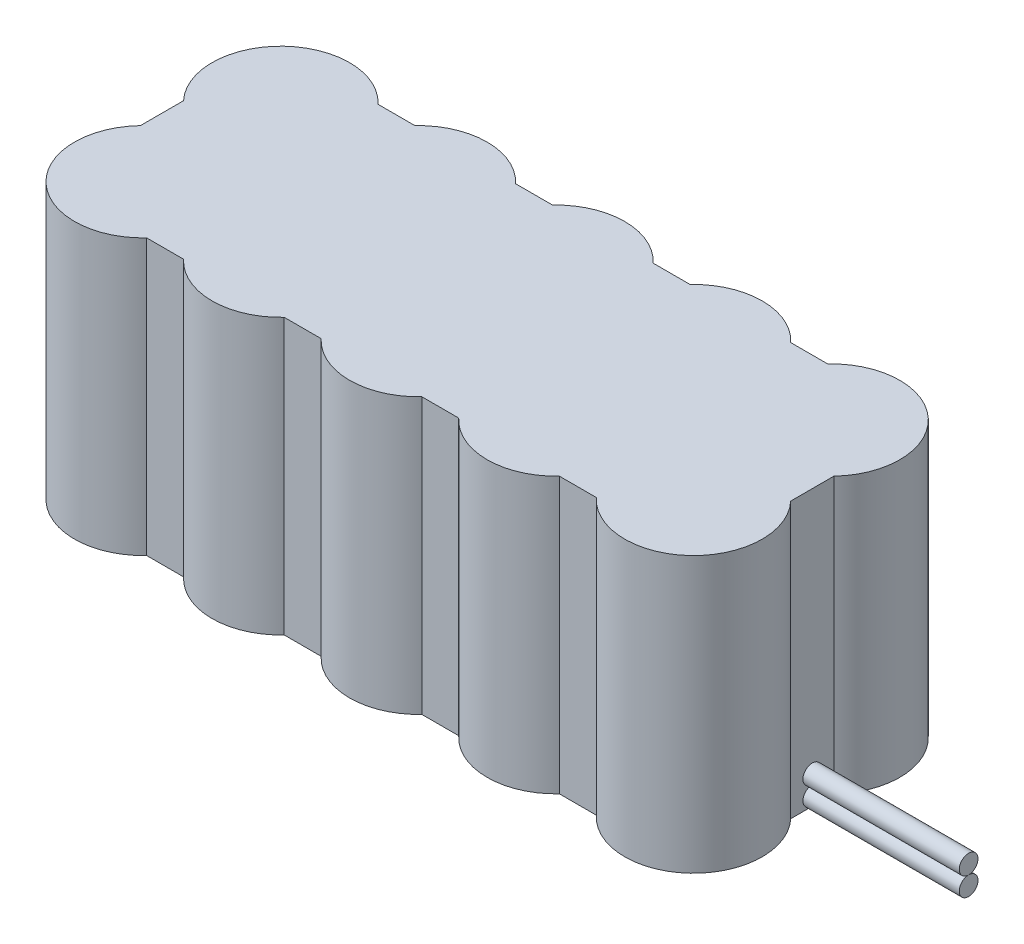
ISO-10303-21;
HEADER;
FILE_DESCRIPTION(('STEP AP214'),'2;1');
FILE_NAME('part.step','',(''),(''),'','','');
FILE_SCHEMA(('AUTOMOTIVE_DESIGN { 1 0 10303 214 1 1 1 1 }'));
ENDSEC;
DATA;
#1=APPLICATION_CONTEXT('core data for automotive mechanical design processes');
#2=APPLICATION_PROTOCOL_DEFINITION('international standard','automotive_design',2000,#1);
#3=PRODUCT_CONTEXT('',#1,'mechanical');
#4=PRODUCT('Part','Part','',(#3));
#5=PRODUCT_RELATED_PRODUCT_CATEGORY('part','',(#4));
#6=PRODUCT_DEFINITION_FORMATION('','',#4);
#7=PRODUCT_DEFINITION_CONTEXT('part definition',#1,'design');
#8=PRODUCT_DEFINITION('design','',#6,#7);
#9=PRODUCT_DEFINITION_SHAPE('','',#8);
#10=(LENGTH_UNIT() NAMED_UNIT(*) SI_UNIT(.MILLI.,.METRE.));
#11=(NAMED_UNIT(*) PLANE_ANGLE_UNIT() SI_UNIT($,.RADIAN.));
#12=(NAMED_UNIT(*) SI_UNIT($,.STERADIAN.) SOLID_ANGLE_UNIT());
#13=UNCERTAINTY_MEASURE_WITH_UNIT(LENGTH_MEASURE(1.E-05),#10,'distance_accuracy_value','');
#14=(GEOMETRIC_REPRESENTATION_CONTEXT(3) GLOBAL_UNCERTAINTY_ASSIGNED_CONTEXT((#13)) GLOBAL_UNIT_ASSIGNED_CONTEXT((#10,
#11,#12)) REPRESENTATION_CONTEXT('',''));
#15=CARTESIAN_POINT('',(0.,0.,0.));
#16=DIRECTION('',(0.,0.,1.));
#17=DIRECTION('',(1.,0.,0.));
#18=AXIS2_PLACEMENT_3D('',#15,#16,#17);
#19=CARTESIAN_POINT('',(121.,0.,0.));
#20=DIRECTION('',(1.,0.,0.));
#21=DIRECTION('',(0.,0.,-1.));
#22=AXIS2_PLACEMENT_3D('',#19,#20,#21);
#23=PLANE('',#22);
#24=CARTESIAN_POINT('',(121.,1.5,0.));
#25=DIRECTION('',(1.,0.,0.));
#26=DIRECTION('',(0.,0.,-1.));
#27=AXIS2_PLACEMENT_3D('',#24,#25,#26);
#28=CIRCLE('',#27,1.5);
#29=CARTESIAN_POINT('',(121.,1.5,-1.5));
#30=VERTEX_POINT('',#29);
#31=EDGE_CURVE('E19',#30,#30,#28,.T.);
#32=ORIENTED_EDGE('',*,*,#31,.T.);
#33=EDGE_LOOP('',(#32));
#34=FACE_BOUND('',#33,.T.);
#35=ADVANCED_FACE('F16',(#34),#23,.T.);
#36=CARTESIAN_POINT('',(96.,1.5,0.));
#37=DIRECTION('',(1.,0.,0.));
#38=DIRECTION('',(0.,0.,-1.));
#39=AXIS2_PLACEMENT_3D('',#36,#37,#38);
#40=CYLINDRICAL_SURFACE('',#39,1.5);
#41=ORIENTED_EDGE('',*,*,#31,.F.);
#42=EDGE_LOOP('',(#41));
#43=FACE_BOUND('',#42,.T.);
#44=CARTESIAN_POINT('',(96.,1.5,0.));
#45=DIRECTION('',(1.,0.,0.));
#46=DIRECTION('',(0.,0.,-1.));
#47=AXIS2_PLACEMENT_3D('',#44,#45,#46);
#48=CIRCLE('',#47,1.5);
#49=CARTESIAN_POINT('',(96.,0.,0.));
#50=VERTEX_POINT('',#49);
#51=CARTESIAN_POINT('',(96.,3.,0.));
#52=VERTEX_POINT('',#51);
#53=EDGE_CURVE('E244',#50,#52,#48,.T.);
#54=ORIENTED_EDGE('',*,*,#53,.T.);
#55=CARTESIAN_POINT('',(96.,1.5,0.));
#56=DIRECTION('',(1.,0.,0.));
#57=DIRECTION('',(0.,0.,-1.));
#58=AXIS2_PLACEMENT_3D('',#55,#56,#57);
#59=CIRCLE('',#58,1.5);
#60=EDGE_CURVE('E46',#52,#50,#59,.T.);
#61=ORIENTED_EDGE('',*,*,#60,.T.);
#62=EDGE_LOOP('',(#54,#61));
#63=FACE_BOUND('',#62,.T.);
#64=ADVANCED_FACE('F424',(#43,#63),#40,.T.);
#65=CARTESIAN_POINT('',(121.,0.,0.));
#66=DIRECTION('',(1.,0.,0.));
#67=DIRECTION('',(0.,0.,-1.));
#68=AXIS2_PLACEMENT_3D('',#65,#66,#67);
#69=PLANE('',#68);
#70=CARTESIAN_POINT('',(121.,4.5,0.));
#71=DIRECTION('',(1.,0.,0.));
#72=DIRECTION('',(0.,0.,-1.));
#73=AXIS2_PLACEMENT_3D('',#70,#71,#72);
#74=CIRCLE('',#73,1.5);
#75=CARTESIAN_POINT('',(121.,4.5,-1.5));
#76=VERTEX_POINT('',#75);
#77=EDGE_CURVE('E24',#76,#76,#74,.T.);
#78=ORIENTED_EDGE('',*,*,#77,.T.);
#79=EDGE_LOOP('',(#78));
#80=FACE_BOUND('',#79,.T.);
#81=ADVANCED_FACE('F416',(#80),#69,.T.);
#82=CARTESIAN_POINT('',(96.,0.,18.5));
#83=DIRECTION('',(1.,0.,0.));
#84=DIRECTION('',(0.,0.,-1.));
#85=AXIS2_PLACEMENT_3D('',#82,#83,#84);
#86=PLANE('',#85);
#87=DIRECTION('',(0.,0.,-1.));
#88=VECTOR('',#87,1.);
#89=CARTESIAN_POINT('',(96.,0.,0.));
#90=LINE('',#89,#88);
#91=CARTESIAN_POINT('',(96.,0.,-3.45016556472926));
#92=VERTEX_POINT('',#91);
#93=EDGE_CURVE('E237',#50,#92,#90,.T.);
#94=ORIENTED_EDGE('',*,*,#93,.T.);
#95=DIRECTION('',(0.,1.,0.));
#96=VECTOR('',#95,1.);
#97=CARTESIAN_POINT('',(96.,22.,-3.45016556472926));
#98=LINE('',#97,#96);
#99=CARTESIAN_POINT('',(96.,43.9999998333333,-3.45016556472926));
#100=VERTEX_POINT('',#99);
#101=EDGE_CURVE('E240',#92,#100,#98,.T.);
#102=ORIENTED_EDGE('',*,*,#101,.T.);
#103=DIRECTION('',(0.,0.,1.));
#104=VECTOR('',#103,1.);
#105=CARTESIAN_POINT('',(96.,44.,0.));
#106=LINE('',#105,#104);
#107=CARTESIAN_POINT('',(96.,43.9999998333333,3.45016556472925));
#108=VERTEX_POINT('',#107);
#109=EDGE_CURVE('E412',#100,#108,#106,.T.);
#110=ORIENTED_EDGE('',*,*,#109,.T.);
#111=DIRECTION('',(0.,1.,0.));
#112=VECTOR('',#111,1.);
#113=CARTESIAN_POINT('',(96.,22.,3.45016556472925));
#114=LINE('',#113,#112);
#115=CARTESIAN_POINT('',(96.,0.,3.45016556472925));
#116=VERTEX_POINT('',#115);
#117=EDGE_CURVE('E58',#116,#108,#114,.T.);
#118=ORIENTED_EDGE('',*,*,#117,.F.);
#119=DIRECTION('',(0.,0.,-1.));
#120=VECTOR('',#119,1.);
#121=CARTESIAN_POINT('',(96.,0.,0.));
#122=LINE('',#121,#120);
#123=EDGE_CURVE('E241',#116,#50,#122,.T.);
#124=ORIENTED_EDGE('',*,*,#123,.T.);
#125=ORIENTED_EDGE('',*,*,#60,.F.);
#126=CARTESIAN_POINT('',(96.,4.5,0.));
#127=DIRECTION('',(1.,0.,0.));
#128=DIRECTION('',(0.,0.,-1.));
#129=AXIS2_PLACEMENT_3D('',#126,#127,#128);
#130=CIRCLE('',#129,1.5);
#131=EDGE_CURVE('E11',#52,#52,#130,.T.);
#132=ORIENTED_EDGE('',*,*,#131,.F.);
#133=ORIENTED_EDGE('',*,*,#53,.F.);
#134=EDGE_LOOP('',(#94,#102,#110,#118,#124,#125,#132,#133));
#135=FACE_BOUND('',#134,.T.);
#136=ADVANCED_FACE('F414',(#135),#86,.T.);
#137=CARTESIAN_POINT('',(0.,0.,0.));
#138=DIRECTION('',(0.,1.,0.));
#139=DIRECTION('',(0.,0.,1.));
#140=AXIS2_PLACEMENT_3D('',#137,#138,#139);
#141=PLANE('',#140);
#142=CARTESIAN_POINT('',(88.,0.,11.));
#143=DIRECTION('',(0.,1.,0.));
#144=DIRECTION('',(0.,0.,1.));
#145=AXIS2_PLACEMENT_3D('',#142,#143,#144);
#146=CIRCLE('',#145,11.);
#147=CARTESIAN_POINT('',(79.9532615302845,0.,18.5));
#148=VERTEX_POINT('',#147);
#149=EDGE_CURVE('E245',#148,#116,#146,.T.);
#150=ORIENTED_EDGE('',*,*,#149,.F.);
#151=DIRECTION('',(1.,0.,0.));
#152=VECTOR('',#151,1.);
#153=CARTESIAN_POINT('',(-8.,0.,18.5));
#154=LINE('',#153,#152);
#155=CARTESIAN_POINT('',(74.0467384697155,0.,18.5));
#156=VERTEX_POINT('',#155);
#157=EDGE_CURVE('E187',#156,#148,#154,.T.);
#158=ORIENTED_EDGE('',*,*,#157,.F.);
#159=CARTESIAN_POINT('',(66.,0.,11.));
#160=DIRECTION('',(0.,1.,0.));
#161=DIRECTION('',(0.,0.,1.));
#162=AXIS2_PLACEMENT_3D('',#159,#160,#161);
#163=CIRCLE('',#162,11.);
#164=CARTESIAN_POINT('',(57.9532615302845,0.,18.5));
#165=VERTEX_POINT('',#164);
#166=EDGE_CURVE('E249',#165,#156,#163,.T.);
#167=ORIENTED_EDGE('',*,*,#166,.F.);
#168=DIRECTION('',(1.,0.,0.));
#169=VECTOR('',#168,1.);
#170=CARTESIAN_POINT('',(-8.,0.,18.5));
#171=LINE('',#170,#169);
#172=CARTESIAN_POINT('',(52.0467384697155,0.,18.5));
#173=VERTEX_POINT('',#172);
#174=EDGE_CURVE('E256',#173,#165,#171,.T.);
#175=ORIENTED_EDGE('',*,*,#174,.F.);
#176=CARTESIAN_POINT('',(44.,0.,11.));
#177=DIRECTION('',(0.,1.,0.));
#178=DIRECTION('',(0.,0.,1.));
#179=AXIS2_PLACEMENT_3D('',#176,#177,#178);
#180=CIRCLE('',#179,11.);
#181=CARTESIAN_POINT('',(35.9532615302845,0.,18.5));
#182=VERTEX_POINT('',#181);
#183=EDGE_CURVE('E259',#182,#173,#180,.T.);
#184=ORIENTED_EDGE('',*,*,#183,.F.);
#185=DIRECTION('',(1.,0.,0.));
#186=VECTOR('',#185,1.);
#187=CARTESIAN_POINT('',(-8.,0.,18.5));
#188=LINE('',#187,#186);
#189=CARTESIAN_POINT('',(30.0467384697155,0.,18.5));
#190=VERTEX_POINT('',#189);
#191=EDGE_CURVE('E262',#190,#182,#188,.T.);
#192=ORIENTED_EDGE('',*,*,#191,.F.);
#193=CARTESIAN_POINT('',(22.,0.,11.));
#194=DIRECTION('',(0.,1.,0.));
#195=DIRECTION('',(0.,0.,1.));
#196=AXIS2_PLACEMENT_3D('',#193,#194,#195);
#197=CIRCLE('',#196,11.);
#198=CARTESIAN_POINT('',(13.9532615302845,0.,18.5));
#199=VERTEX_POINT('',#198);
#200=EDGE_CURVE('E265',#199,#190,#197,.T.);
#201=ORIENTED_EDGE('',*,*,#200,.F.);
#202=DIRECTION('',(1.,0.,0.));
#203=VECTOR('',#202,1.);
#204=CARTESIAN_POINT('',(-8.,0.,18.5));
#205=LINE('',#204,#203);
#206=CARTESIAN_POINT('',(8.04673846971554,0.,18.5));
#207=VERTEX_POINT('',#206);
#208=EDGE_CURVE('E268',#207,#199,#205,.T.);
#209=ORIENTED_EDGE('',*,*,#208,.F.);
#210=CARTESIAN_POINT('',(0.,0.,11.));
#211=DIRECTION('',(0.,1.,0.));
#212=DIRECTION('',(0.,0.,1.));
#213=AXIS2_PLACEMENT_3D('',#210,#211,#212);
#214=CIRCLE('',#213,11.);
#215=CARTESIAN_POINT('',(-8.,0.,3.45016556472925));
#216=VERTEX_POINT('',#215);
#217=EDGE_CURVE('E271',#216,#207,#214,.T.);
#218=ORIENTED_EDGE('',*,*,#217,.F.);
#219=DIRECTION('',(0.,0.,1.));
#220=VECTOR('',#219,1.);
#221=CARTESIAN_POINT('',(-8.,0.,-18.5));
#222=LINE('',#221,#220);
#223=CARTESIAN_POINT('',(-8.,0.,-3.45016556472925));
#224=VERTEX_POINT('',#223);
#225=EDGE_CURVE('E274',#224,#216,#222,.T.);
#226=ORIENTED_EDGE('',*,*,#225,.F.);
#227=CARTESIAN_POINT('',(0.,0.,-11.));
#228=DIRECTION('',(0.,1.,0.));
#229=DIRECTION('',(0.,0.,1.));
#230=AXIS2_PLACEMENT_3D('',#227,#228,#229);
#231=CIRCLE('',#230,11.);
#232=CARTESIAN_POINT('',(8.04673846971554,0.,-18.5));
#233=VERTEX_POINT('',#232);
#234=EDGE_CURVE('E277',#233,#224,#231,.T.);
#235=ORIENTED_EDGE('',*,*,#234,.F.);
#236=DIRECTION('',(-1.,0.,0.));
#237=VECTOR('',#236,1.);
#238=CARTESIAN_POINT('',(96.,0.,-18.5));
#239=LINE('',#238,#237);
#240=CARTESIAN_POINT('',(13.9532615302845,0.,-18.5));
#241=VERTEX_POINT('',#240);
#242=EDGE_CURVE('E280',#241,#233,#239,.T.);
#243=ORIENTED_EDGE('',*,*,#242,.F.);
#244=CARTESIAN_POINT('',(22.,0.,-11.));
#245=DIRECTION('',(0.,1.,0.));
#246=DIRECTION('',(0.,0.,1.));
#247=AXIS2_PLACEMENT_3D('',#244,#245,#246);
#248=CIRCLE('',#247,11.);
#249=CARTESIAN_POINT('',(30.0467384697155,0.,-18.5));
#250=VERTEX_POINT('',#249);
#251=EDGE_CURVE('E283',#250,#241,#248,.T.);
#252=ORIENTED_EDGE('',*,*,#251,.F.);
#253=DIRECTION('',(-1.,0.,0.));
#254=VECTOR('',#253,1.);
#255=CARTESIAN_POINT('',(96.,0.,-18.5));
#256=LINE('',#255,#254);
#257=CARTESIAN_POINT('',(35.9532615302845,0.,-18.5));
#258=VERTEX_POINT('',#257);
#259=EDGE_CURVE('E286',#258,#250,#256,.T.);
#260=ORIENTED_EDGE('',*,*,#259,.F.);
#261=CARTESIAN_POINT('',(44.,0.,-11.));
#262=DIRECTION('',(0.,1.,0.));
#263=DIRECTION('',(0.,0.,1.));
#264=AXIS2_PLACEMENT_3D('',#261,#262,#263);
#265=CIRCLE('',#264,11.);
#266=CARTESIAN_POINT('',(52.0467384697155,0.,-18.5));
#267=VERTEX_POINT('',#266);
#268=EDGE_CURVE('E289',#267,#258,#265,.T.);
#269=ORIENTED_EDGE('',*,*,#268,.F.);
#270=DIRECTION('',(-1.,0.,0.));
#271=VECTOR('',#270,1.);
#272=CARTESIAN_POINT('',(96.,0.,-18.5));
#273=LINE('',#272,#271);
#274=CARTESIAN_POINT('',(57.9532615302845,0.,-18.5));
#275=VERTEX_POINT('',#274);
#276=EDGE_CURVE('E292',#275,#267,#273,.T.);
#277=ORIENTED_EDGE('',*,*,#276,.F.);
#278=CARTESIAN_POINT('',(66.,0.,-11.));
#279=DIRECTION('',(0.,1.,0.));
#280=DIRECTION('',(0.,0.,1.));
#281=AXIS2_PLACEMENT_3D('',#278,#279,#280);
#282=CIRCLE('',#281,11.);
#283=CARTESIAN_POINT('',(74.0467384697155,0.,-18.5));
#284=VERTEX_POINT('',#283);
#285=EDGE_CURVE('E295',#284,#275,#282,.T.);
#286=ORIENTED_EDGE('',*,*,#285,.F.);
#287=DIRECTION('',(-1.,0.,0.));
#288=VECTOR('',#287,1.);
#289=CARTESIAN_POINT('',(96.,0.,-18.5));
#290=LINE('',#289,#288);
#291=CARTESIAN_POINT('',(79.9532615302845,0.,-18.5));
#292=VERTEX_POINT('',#291);
#293=EDGE_CURVE('E298',#292,#284,#290,.T.);
#294=ORIENTED_EDGE('',*,*,#293,.F.);
#295=CARTESIAN_POINT('',(88.,0.,-11.));
#296=DIRECTION('',(0.,1.,0.));
#297=DIRECTION('',(0.,0.,1.));
#298=AXIS2_PLACEMENT_3D('',#295,#296,#297);
#299=CIRCLE('',#298,11.);
#300=EDGE_CURVE('E301',#92,#292,#299,.T.);
#301=ORIENTED_EDGE('',*,*,#300,.F.);
#302=ORIENTED_EDGE('',*,*,#93,.F.);
#303=ORIENTED_EDGE('',*,*,#123,.F.);
#304=EDGE_LOOP('',(#150,#158,#167,#175,#184,#192,#201,#209,#218,#226,#235,#243,#252,#260,#269,
#277,#286,#294,#301,#302,#303));
#305=FACE_BOUND('',#304,.T.);
#306=ADVANCED_FACE('F348',(#305),#141,.F.);
#307=CARTESIAN_POINT('',(88.,0.,-11.));
#308=DIRECTION('',(0.,1.,0.));
#309=DIRECTION('',(0.,0.,1.));
#310=AXIS2_PLACEMENT_3D('',#307,#308,#309);
#311=CYLINDRICAL_SURFACE('',#310,11.);
#312=CARTESIAN_POINT('',(88.,44.,-11.));
#313=DIRECTION('',(0.,1.,0.));
#314=DIRECTION('',(0.,0.,1.));
#315=AXIS2_PLACEMENT_3D('',#312,#313,#314);
#316=CIRCLE('',#315,11.);
#317=CARTESIAN_POINT('',(79.9532615302845,44.,-18.5));
#318=VERTEX_POINT('',#317);
#319=EDGE_CURVE('E304',#100,#318,#316,.T.);
#320=ORIENTED_EDGE('',*,*,#319,.F.);
#321=ORIENTED_EDGE('',*,*,#101,.F.);
#322=ORIENTED_EDGE('',*,*,#300,.T.);
#323=DIRECTION('',(0.,1.,0.));
#324=VECTOR('',#323,1.);
#325=CARTESIAN_POINT('',(79.9532615302845,0.,-18.5));
#326=LINE('',#325,#324);
#327=EDGE_CURVE('E306',#292,#318,#326,.T.);
#328=ORIENTED_EDGE('',*,*,#327,.T.);
#329=EDGE_LOOP('',(#320,#321,#322,#328));
#330=FACE_BOUND('',#329,.T.);
#331=ADVANCED_FACE('F409',(#330),#311,.T.);
#332=CARTESIAN_POINT('',(0.,44.,0.));
#333=DIRECTION('',(0.,1.,0.));
#334=DIRECTION('',(0.,0.,1.));
#335=AXIS2_PLACEMENT_3D('',#332,#333,#334);
#336=PLANE('',#335);
#337=ORIENTED_EDGE('',*,*,#109,.F.);
#338=ORIENTED_EDGE('',*,*,#319,.T.);
#339=DIRECTION('',(1.,0.,0.));
#340=VECTOR('',#339,1.);
#341=CARTESIAN_POINT('',(0.,44.,-18.5));
#342=LINE('',#341,#340);
#343=CARTESIAN_POINT('',(74.0467384697155,44.,-18.5));
#344=VERTEX_POINT('',#343);
#345=EDGE_CURVE('E309',#318,#344,#342,.F.);
#346=ORIENTED_EDGE('',*,*,#345,.T.);
#347=CARTESIAN_POINT('',(66.,44.,-11.));
#348=DIRECTION('',(0.,1.,0.));
#349=DIRECTION('',(0.,0.,1.));
#350=AXIS2_PLACEMENT_3D('',#347,#348,#349);
#351=CIRCLE('',#350,11.);
#352=CARTESIAN_POINT('',(57.9532615302845,44.,-18.5));
#353=VERTEX_POINT('',#352);
#354=EDGE_CURVE('E311',#344,#353,#351,.T.);
#355=ORIENTED_EDGE('',*,*,#354,.T.);
#356=DIRECTION('',(1.,0.,0.));
#357=VECTOR('',#356,1.);
#358=CARTESIAN_POINT('',(0.,44.,-18.5));
#359=LINE('',#358,#357);
#360=CARTESIAN_POINT('',(52.0467384697155,44.,-18.5));
#361=VERTEX_POINT('',#360);
#362=EDGE_CURVE('E313',#353,#361,#359,.F.);
#363=ORIENTED_EDGE('',*,*,#362,.T.);
#364=CARTESIAN_POINT('',(44.,44.,-11.));
#365=DIRECTION('',(0.,1.,0.));
#366=DIRECTION('',(0.,0.,1.));
#367=AXIS2_PLACEMENT_3D('',#364,#365,#366);
#368=CIRCLE('',#367,11.);
#369=CARTESIAN_POINT('',(35.9532615302845,44.,-18.5));
#370=VERTEX_POINT('',#369);
#371=EDGE_CURVE('E315',#361,#370,#368,.T.);
#372=ORIENTED_EDGE('',*,*,#371,.T.);
#373=DIRECTION('',(1.,0.,0.));
#374=VECTOR('',#373,1.);
#375=CARTESIAN_POINT('',(0.,44.,-18.5));
#376=LINE('',#375,#374);
#377=CARTESIAN_POINT('',(30.0467384697155,44.,-18.5));
#378=VERTEX_POINT('',#377);
#379=EDGE_CURVE('E317',#370,#378,#376,.F.);
#380=ORIENTED_EDGE('',*,*,#379,.T.);
#381=CARTESIAN_POINT('',(22.,44.,-11.));
#382=DIRECTION('',(0.,1.,0.));
#383=DIRECTION('',(0.,0.,1.));
#384=AXIS2_PLACEMENT_3D('',#381,#382,#383);
#385=CIRCLE('',#384,11.);
#386=CARTESIAN_POINT('',(13.9532615302845,44.,-18.5));
#387=VERTEX_POINT('',#386);
#388=EDGE_CURVE('E319',#378,#387,#385,.T.);
#389=ORIENTED_EDGE('',*,*,#388,.T.);
#390=DIRECTION('',(1.,0.,0.));
#391=VECTOR('',#390,1.);
#392=CARTESIAN_POINT('',(0.,44.,-18.5));
#393=LINE('',#392,#391);
#394=CARTESIAN_POINT('',(8.04673846971554,44.,-18.5));
#395=VERTEX_POINT('',#394);
#396=EDGE_CURVE('E321',#387,#395,#393,.F.);
#397=ORIENTED_EDGE('',*,*,#396,.T.);
#398=CARTESIAN_POINT('',(0.,44.,-11.));
#399=DIRECTION('',(0.,1.,0.));
#400=DIRECTION('',(0.,0.,1.));
#401=AXIS2_PLACEMENT_3D('',#398,#399,#400);
#402=CIRCLE('',#401,11.);
#403=CARTESIAN_POINT('',(-8.,44.,-3.45016556472925));
#404=VERTEX_POINT('',#403);
#405=EDGE_CURVE('E323',#395,#404,#402,.T.);
#406=ORIENTED_EDGE('',*,*,#405,.T.);
#407=DIRECTION('',(0.,0.,1.));
#408=VECTOR('',#407,1.);
#409=CARTESIAN_POINT('',(-8.,44.,0.));
#410=LINE('',#409,#408);
#411=CARTESIAN_POINT('',(-8.,44.,3.45016556472925));
#412=VERTEX_POINT('',#411);
#413=EDGE_CURVE('E325',#404,#412,#410,.T.);
#414=ORIENTED_EDGE('',*,*,#413,.T.);
#415=CARTESIAN_POINT('',(0.,44.,11.));
#416=DIRECTION('',(0.,1.,0.));
#417=DIRECTION('',(0.,0.,1.));
#418=AXIS2_PLACEMENT_3D('',#415,#416,#417);
#419=CIRCLE('',#418,11.);
#420=CARTESIAN_POINT('',(8.04673846971554,44.,18.5));
#421=VERTEX_POINT('',#420);
#422=EDGE_CURVE('E327',#412,#421,#419,.T.);
#423=ORIENTED_EDGE('',*,*,#422,.T.);
#424=DIRECTION('',(1.,0.,0.));
#425=VECTOR('',#424,1.);
#426=CARTESIAN_POINT('',(0.,44.,18.5));
#427=LINE('',#426,#425);
#428=CARTESIAN_POINT('',(13.9532615302845,44.,18.5));
#429=VERTEX_POINT('',#428);
#430=EDGE_CURVE('E329',#421,#429,#427,.T.);
#431=ORIENTED_EDGE('',*,*,#430,.T.);
#432=CARTESIAN_POINT('',(22.,44.,11.));
#433=DIRECTION('',(0.,1.,0.));
#434=DIRECTION('',(0.,0.,1.));
#435=AXIS2_PLACEMENT_3D('',#432,#433,#434);
#436=CIRCLE('',#435,11.);
#437=CARTESIAN_POINT('',(30.0467384697155,44.,18.5));
#438=VERTEX_POINT('',#437);
#439=EDGE_CURVE('E331',#429,#438,#436,.T.);
#440=ORIENTED_EDGE('',*,*,#439,.T.);
#441=DIRECTION('',(1.,0.,0.));
#442=VECTOR('',#441,1.);
#443=CARTESIAN_POINT('',(0.,44.,18.5));
#444=LINE('',#443,#442);
#445=CARTESIAN_POINT('',(35.9532615302845,44.,18.5));
#446=VERTEX_POINT('',#445);
#447=EDGE_CURVE('E333',#438,#446,#444,.T.);
#448=ORIENTED_EDGE('',*,*,#447,.T.);
#449=CARTESIAN_POINT('',(44.,44.,11.));
#450=DIRECTION('',(0.,1.,0.));
#451=DIRECTION('',(0.,0.,1.));
#452=AXIS2_PLACEMENT_3D('',#449,#450,#451);
#453=CIRCLE('',#452,11.);
#454=CARTESIAN_POINT('',(52.0467384697155,44.,18.5));
#455=VERTEX_POINT('',#454);
#456=EDGE_CURVE('E335',#446,#455,#453,.T.);
#457=ORIENTED_EDGE('',*,*,#456,.T.);
#458=DIRECTION('',(1.,0.,0.));
#459=VECTOR('',#458,1.);
#460=CARTESIAN_POINT('',(0.,44.,18.5));
#461=LINE('',#460,#459);
#462=CARTESIAN_POINT('',(57.9532615302845,44.,18.5));
#463=VERTEX_POINT('',#462);
#464=EDGE_CURVE('E337',#455,#463,#461,.T.);
#465=ORIENTED_EDGE('',*,*,#464,.T.);
#466=CARTESIAN_POINT('',(66.,44.,11.));
#467=DIRECTION('',(0.,1.,0.));
#468=DIRECTION('',(0.,0.,1.));
#469=AXIS2_PLACEMENT_3D('',#466,#467,#468);
#470=CIRCLE('',#469,11.);
#471=CARTESIAN_POINT('',(74.0467384697155,44.,18.5));
#472=VERTEX_POINT('',#471);
#473=EDGE_CURVE('E166',#463,#472,#470,.T.);
#474=ORIENTED_EDGE('',*,*,#473,.T.);
#475=DIRECTION('',(1.,0.,0.));
#476=VECTOR('',#475,1.);
#477=CARTESIAN_POINT('',(0.,44.,18.5));
#478=LINE('',#477,#476);
#479=CARTESIAN_POINT('',(79.9532615302845,44.,18.5));
#480=VERTEX_POINT('',#479);
#481=EDGE_CURVE('E169',#472,#480,#478,.T.);
#482=ORIENTED_EDGE('',*,*,#481,.T.);
#483=CARTESIAN_POINT('',(88.,44.,11.));
#484=DIRECTION('',(0.,1.,0.));
#485=DIRECTION('',(0.,0.,1.));
#486=AXIS2_PLACEMENT_3D('',#483,#484,#485);
#487=CIRCLE('',#486,11.);
#488=EDGE_CURVE('E173',#480,#108,#487,.T.);
#489=ORIENTED_EDGE('',*,*,#488,.T.);
#490=EDGE_LOOP('',(#337,#338,#346,#355,#363,#372,#380,#389,#397,#406,#414,#423,#431,#440,#448,
#457,#465,#474,#482,#489));
#491=FACE_BOUND('',#490,.T.);
#492=ADVANCED_FACE('F172',(#491),#336,.T.);
#493=CARTESIAN_POINT('',(88.,0.,11.));
#494=DIRECTION('',(0.,1.,0.));
#495=DIRECTION('',(0.,0.,1.));
#496=AXIS2_PLACEMENT_3D('',#493,#494,#495);
#497=CYLINDRICAL_SURFACE('',#496,11.);
#498=ORIENTED_EDGE('',*,*,#488,.F.);
#499=DIRECTION('',(0.,1.,0.));
#500=VECTOR('',#499,1.);
#501=CARTESIAN_POINT('',(79.9532615302845,0.,18.5));
#502=LINE('',#501,#500);
#503=EDGE_CURVE('E183',#480,#148,#502,.F.);
#504=ORIENTED_EDGE('',*,*,#503,.T.);
#505=ORIENTED_EDGE('',*,*,#149,.T.);
#506=ORIENTED_EDGE('',*,*,#117,.T.);
#507=EDGE_LOOP('',(#498,#504,#505,#506));
#508=FACE_BOUND('',#507,.T.);
#509=ADVANCED_FACE('F181',(#508),#497,.T.);
#510=CARTESIAN_POINT('',(-8.,0.,18.5));
#511=DIRECTION('',(0.,0.,1.));
#512=DIRECTION('',(1.,0.,0.));
#513=AXIS2_PLACEMENT_3D('',#510,#511,#512);
#514=PLANE('',#513);
#515=DIRECTION('',(0.,1.,0.));
#516=VECTOR('',#515,1.);
#517=CARTESIAN_POINT('',(74.0467384697155,0.,18.5));
#518=LINE('',#517,#516);
#519=EDGE_CURVE('E188',#472,#156,#518,.F.);
#520=ORIENTED_EDGE('',*,*,#519,.T.);
#521=ORIENTED_EDGE('',*,*,#157,.T.);
#522=ORIENTED_EDGE('',*,*,#503,.F.);
#523=ORIENTED_EDGE('',*,*,#481,.F.);
#524=EDGE_LOOP('',(#520,#521,#522,#523));
#525=FACE_BOUND('',#524,.T.);
#526=ADVANCED_FACE('F186',(#525),#514,.T.);
#527=CARTESIAN_POINT('',(66.,0.,11.));
#528=DIRECTION('',(0.,1.,0.));
#529=DIRECTION('',(0.,0.,1.));
#530=AXIS2_PLACEMENT_3D('',#527,#528,#529);
#531=CYLINDRICAL_SURFACE('',#530,11.);
#532=ORIENTED_EDGE('',*,*,#519,.F.);
#533=ORIENTED_EDGE('',*,*,#473,.F.);
#534=DIRECTION('',(0.,1.,0.));
#535=VECTOR('',#534,1.);
#536=CARTESIAN_POINT('',(57.9532615302845,0.,18.5));
#537=LINE('',#536,#535);
#538=EDGE_CURVE('E190',#463,#165,#537,.F.);
#539=ORIENTED_EDGE('',*,*,#538,.T.);
#540=ORIENTED_EDGE('',*,*,#166,.T.);
#541=EDGE_LOOP('',(#532,#533,#539,#540));
#542=FACE_BOUND('',#541,.T.);
#543=ADVANCED_FACE('F345',(#542),#531,.T.);
#544=CARTESIAN_POINT('',(-8.,0.,18.5));
#545=DIRECTION('',(0.,0.,1.));
#546=DIRECTION('',(1.,0.,0.));
#547=AXIS2_PLACEMENT_3D('',#544,#545,#546);
#548=PLANE('',#547);
#549=DIRECTION('',(0.,1.,0.));
#550=VECTOR('',#549,1.);
#551=CARTESIAN_POINT('',(52.0467384697155,0.,18.5));
#552=LINE('',#551,#550);
#553=EDGE_CURVE('E195',#455,#173,#552,.F.);
#554=ORIENTED_EDGE('',*,*,#553,.T.);
#555=ORIENTED_EDGE('',*,*,#174,.T.);
#556=ORIENTED_EDGE('',*,*,#538,.F.);
#557=ORIENTED_EDGE('',*,*,#464,.F.);
#558=EDGE_LOOP('',(#554,#555,#556,#557));
#559=FACE_BOUND('',#558,.T.);
#560=ADVANCED_FACE('F346',(#559),#548,.T.);
#561=CARTESIAN_POINT('',(44.,0.,11.));
#562=DIRECTION('',(0.,1.,0.));
#563=DIRECTION('',(0.,0.,1.));
#564=AXIS2_PLACEMENT_3D('',#561,#562,#563);
#565=CYLINDRICAL_SURFACE('',#564,11.);
#566=ORIENTED_EDGE('',*,*,#553,.F.);
#567=ORIENTED_EDGE('',*,*,#456,.F.);
#568=DIRECTION('',(0.,1.,0.));
#569=VECTOR('',#568,1.);
#570=CARTESIAN_POINT('',(35.9532615302845,0.,18.5));
#571=LINE('',#570,#569);
#572=EDGE_CURVE('E198',#446,#182,#571,.F.);
#573=ORIENTED_EDGE('',*,*,#572,.T.);
#574=ORIENTED_EDGE('',*,*,#183,.T.);
#575=EDGE_LOOP('',(#566,#567,#573,#574));
#576=FACE_BOUND('',#575,.T.);
#577=ADVANCED_FACE('F350',(#576),#565,.T.);
#578=CARTESIAN_POINT('',(-8.,0.,18.5));
#579=DIRECTION('',(0.,0.,1.));
#580=DIRECTION('',(1.,0.,0.));
#581=AXIS2_PLACEMENT_3D('',#578,#579,#580);
#582=PLANE('',#581);
#583=DIRECTION('',(0.,1.,0.));
#584=VECTOR('',#583,1.);
#585=CARTESIAN_POINT('',(30.0467384697155,0.,18.5));
#586=LINE('',#585,#584);
#587=EDGE_CURVE('E201',#438,#190,#586,.F.);
#588=ORIENTED_EDGE('',*,*,#587,.T.);
#589=ORIENTED_EDGE('',*,*,#191,.T.);
#590=ORIENTED_EDGE('',*,*,#572,.F.);
#591=ORIENTED_EDGE('',*,*,#447,.F.);
#592=EDGE_LOOP('',(#588,#589,#590,#591));
#593=FACE_BOUND('',#592,.T.);
#594=ADVANCED_FACE('F354',(#593),#582,.T.);
#595=CARTESIAN_POINT('',(22.,0.,11.));
#596=DIRECTION('',(0.,1.,0.));
#597=DIRECTION('',(0.,0.,1.));
#598=AXIS2_PLACEMENT_3D('',#595,#596,#597);
#599=CYLINDRICAL_SURFACE('',#598,11.);
#600=ORIENTED_EDGE('',*,*,#587,.F.);
#601=ORIENTED_EDGE('',*,*,#439,.F.);
#602=DIRECTION('',(0.,1.,0.));
#603=VECTOR('',#602,1.);
#604=CARTESIAN_POINT('',(13.9532615302845,0.,18.5));
#605=LINE('',#604,#603);
#606=EDGE_CURVE('E204',#429,#199,#605,.F.);
#607=ORIENTED_EDGE('',*,*,#606,.T.);
#608=ORIENTED_EDGE('',*,*,#200,.T.);
#609=EDGE_LOOP('',(#600,#601,#607,#608));
#610=FACE_BOUND('',#609,.T.);
#611=ADVANCED_FACE('F357',(#610),#599,.T.);
#612=CARTESIAN_POINT('',(-8.,0.,18.5));
#613=DIRECTION('',(0.,0.,1.));
#614=DIRECTION('',(1.,0.,0.));
#615=AXIS2_PLACEMENT_3D('',#612,#613,#614);
#616=PLANE('',#615);
#617=DIRECTION('',(0.,1.,0.));
#618=VECTOR('',#617,1.);
#619=CARTESIAN_POINT('',(8.04673846971554,0.,18.5));
#620=LINE('',#619,#618);
#621=EDGE_CURVE('E207',#421,#207,#620,.F.);
#622=ORIENTED_EDGE('',*,*,#621,.T.);
#623=ORIENTED_EDGE('',*,*,#208,.T.);
#624=ORIENTED_EDGE('',*,*,#606,.F.);
#625=ORIENTED_EDGE('',*,*,#430,.F.);
#626=EDGE_LOOP('',(#622,#623,#624,#625));
#627=FACE_BOUND('',#626,.T.);
#628=ADVANCED_FACE('F362',(#627),#616,.T.);
#629=CARTESIAN_POINT('',(0.,0.,11.));
#630=DIRECTION('',(0.,1.,0.));
#631=DIRECTION('',(0.,0.,1.));
#632=AXIS2_PLACEMENT_3D('',#629,#630,#631);
#633=CYLINDRICAL_SURFACE('',#632,11.);
#634=ORIENTED_EDGE('',*,*,#217,.T.);
#635=ORIENTED_EDGE('',*,*,#621,.F.);
#636=ORIENTED_EDGE('',*,*,#422,.F.);
#637=DIRECTION('',(0.,1.,0.));
#638=VECTOR('',#637,1.);
#639=CARTESIAN_POINT('',(-8.,0.,3.45016556472925));
#640=LINE('',#639,#638);
#641=EDGE_CURVE('E210',#412,#216,#640,.F.);
#642=ORIENTED_EDGE('',*,*,#641,.T.);
#643=EDGE_LOOP('',(#634,#635,#636,#642));
#644=FACE_BOUND('',#643,.T.);
#645=ADVANCED_FACE('F365',(#644),#633,.T.);
#646=CARTESIAN_POINT('',(-8.,0.,-18.5));
#647=DIRECTION('',(-1.,0.,0.));
#648=DIRECTION('',(0.,0.,1.));
#649=AXIS2_PLACEMENT_3D('',#646,#647,#648);
#650=PLANE('',#649);
#651=ORIENTED_EDGE('',*,*,#641,.F.);
#652=ORIENTED_EDGE('',*,*,#413,.F.);
#653=DIRECTION('',(0.,1.,0.));
#654=VECTOR('',#653,1.);
#655=CARTESIAN_POINT('',(-8.,0.,-3.45016556472925));
#656=LINE('',#655,#654);
#657=EDGE_CURVE('E213',#404,#224,#656,.F.);
#658=ORIENTED_EDGE('',*,*,#657,.T.);
#659=ORIENTED_EDGE('',*,*,#225,.T.);
#660=EDGE_LOOP('',(#651,#652,#658,#659));
#661=FACE_BOUND('',#660,.T.);
#662=ADVANCED_FACE('F370',(#661),#650,.T.);
#663=CARTESIAN_POINT('',(0.,0.,-11.));
#664=DIRECTION('',(0.,1.,0.));
#665=DIRECTION('',(0.,0.,1.));
#666=AXIS2_PLACEMENT_3D('',#663,#664,#665);
#667=CYLINDRICAL_SURFACE('',#666,11.);
#668=ORIENTED_EDGE('',*,*,#234,.T.);
#669=ORIENTED_EDGE('',*,*,#657,.F.);
#670=ORIENTED_EDGE('',*,*,#405,.F.);
#671=DIRECTION('',(0.,1.,0.));
#672=VECTOR('',#671,1.);
#673=CARTESIAN_POINT('',(8.04673846971554,0.,-18.5));
#674=LINE('',#673,#672);
#675=EDGE_CURVE('E216',#395,#233,#674,.F.);
#676=ORIENTED_EDGE('',*,*,#675,.T.);
#677=EDGE_LOOP('',(#668,#669,#670,#676));
#678=FACE_BOUND('',#677,.T.);
#679=ADVANCED_FACE('F373',(#678),#667,.T.);
#680=CARTESIAN_POINT('',(96.,0.,-18.5));
#681=DIRECTION('',(0.,0.,-1.));
#682=DIRECTION('',(-1.,0.,0.));
#683=AXIS2_PLACEMENT_3D('',#680,#681,#682);
#684=PLANE('',#683);
#685=ORIENTED_EDGE('',*,*,#675,.F.);
#686=ORIENTED_EDGE('',*,*,#396,.F.);
#687=DIRECTION('',(0.,1.,0.));
#688=VECTOR('',#687,1.);
#689=CARTESIAN_POINT('',(13.9532615302845,0.,-18.5));
#690=LINE('',#689,#688);
#691=EDGE_CURVE('E219',#387,#241,#690,.F.);
#692=ORIENTED_EDGE('',*,*,#691,.T.);
#693=ORIENTED_EDGE('',*,*,#242,.T.);
#694=EDGE_LOOP('',(#685,#686,#692,#693));
#695=FACE_BOUND('',#694,.T.);
#696=ADVANCED_FACE('F378',(#695),#684,.T.);
#697=CARTESIAN_POINT('',(22.,0.,-11.));
#698=DIRECTION('',(0.,1.,0.));
#699=DIRECTION('',(0.,0.,1.));
#700=AXIS2_PLACEMENT_3D('',#697,#698,#699);
#701=CYLINDRICAL_SURFACE('',#700,11.);
#702=ORIENTED_EDGE('',*,*,#691,.F.);
#703=ORIENTED_EDGE('',*,*,#388,.F.);
#704=DIRECTION('',(0.,1.,0.));
#705=VECTOR('',#704,1.);
#706=CARTESIAN_POINT('',(30.0467384697155,0.,-18.5));
#707=LINE('',#706,#705);
#708=EDGE_CURVE('E222',#378,#250,#707,.F.);
#709=ORIENTED_EDGE('',*,*,#708,.T.);
#710=ORIENTED_EDGE('',*,*,#251,.T.);
#711=EDGE_LOOP('',(#702,#703,#709,#710));
#712=FACE_BOUND('',#711,.T.);
#713=ADVANCED_FACE('F381',(#712),#701,.T.);
#714=CARTESIAN_POINT('',(96.,0.,-18.5));
#715=DIRECTION('',(0.,0.,-1.));
#716=DIRECTION('',(-1.,0.,0.));
#717=AXIS2_PLACEMENT_3D('',#714,#715,#716);
#718=PLANE('',#717);
#719=ORIENTED_EDGE('',*,*,#708,.F.);
#720=ORIENTED_EDGE('',*,*,#379,.F.);
#721=DIRECTION('',(0.,1.,0.));
#722=VECTOR('',#721,1.);
#723=CARTESIAN_POINT('',(35.9532615302845,0.,-18.5));
#724=LINE('',#723,#722);
#725=EDGE_CURVE('E225',#370,#258,#724,.F.);
#726=ORIENTED_EDGE('',*,*,#725,.T.);
#727=ORIENTED_EDGE('',*,*,#259,.T.);
#728=EDGE_LOOP('',(#719,#720,#726,#727));
#729=FACE_BOUND('',#728,.T.);
#730=ADVANCED_FACE('F386',(#729),#718,.T.);
#731=CARTESIAN_POINT('',(44.,0.,-11.));
#732=DIRECTION('',(0.,1.,0.));
#733=DIRECTION('',(0.,0.,1.));
#734=AXIS2_PLACEMENT_3D('',#731,#732,#733);
#735=CYLINDRICAL_SURFACE('',#734,11.);
#736=ORIENTED_EDGE('',*,*,#725,.F.);
#737=ORIENTED_EDGE('',*,*,#371,.F.);
#738=DIRECTION('',(0.,1.,0.));
#739=VECTOR('',#738,1.);
#740=CARTESIAN_POINT('',(52.0467384697155,0.,-18.5));
#741=LINE('',#740,#739);
#742=EDGE_CURVE('E228',#361,#267,#741,.F.);
#743=ORIENTED_EDGE('',*,*,#742,.T.);
#744=ORIENTED_EDGE('',*,*,#268,.T.);
#745=EDGE_LOOP('',(#736,#737,#743,#744));
#746=FACE_BOUND('',#745,.T.);
#747=ADVANCED_FACE('F389',(#746),#735,.T.);
#748=CARTESIAN_POINT('',(96.,0.,-18.5));
#749=DIRECTION('',(0.,0.,-1.));
#750=DIRECTION('',(-1.,0.,0.));
#751=AXIS2_PLACEMENT_3D('',#748,#749,#750);
#752=PLANE('',#751);
#753=ORIENTED_EDGE('',*,*,#742,.F.);
#754=ORIENTED_EDGE('',*,*,#362,.F.);
#755=DIRECTION('',(0.,1.,0.));
#756=VECTOR('',#755,1.);
#757=CARTESIAN_POINT('',(57.9532615302845,0.,-18.5));
#758=LINE('',#757,#756);
#759=EDGE_CURVE('E231',#353,#275,#758,.F.);
#760=ORIENTED_EDGE('',*,*,#759,.T.);
#761=ORIENTED_EDGE('',*,*,#276,.T.);
#762=EDGE_LOOP('',(#753,#754,#760,#761));
#763=FACE_BOUND('',#762,.T.);
#764=ADVANCED_FACE('F394',(#763),#752,.T.);
#765=CARTESIAN_POINT('',(66.,0.,-11.));
#766=DIRECTION('',(0.,1.,0.));
#767=DIRECTION('',(0.,0.,1.));
#768=AXIS2_PLACEMENT_3D('',#765,#766,#767);
#769=CYLINDRICAL_SURFACE('',#768,11.);
#770=ORIENTED_EDGE('',*,*,#759,.F.);
#771=ORIENTED_EDGE('',*,*,#354,.F.);
#772=DIRECTION('',(0.,1.,0.));
#773=VECTOR('',#772,1.);
#774=CARTESIAN_POINT('',(74.0467384697155,0.,-18.5));
#775=LINE('',#774,#773);
#776=EDGE_CURVE('E234',#344,#284,#775,.F.);
#777=ORIENTED_EDGE('',*,*,#776,.T.);
#778=ORIENTED_EDGE('',*,*,#285,.T.);
#779=EDGE_LOOP('',(#770,#771,#777,#778));
#780=FACE_BOUND('',#779,.T.);
#781=ADVANCED_FACE('F397',(#780),#769,.T.);
#782=CARTESIAN_POINT('',(96.,0.,-18.5));
#783=DIRECTION('',(0.,0.,-1.));
#784=DIRECTION('',(-1.,0.,0.));
#785=AXIS2_PLACEMENT_3D('',#782,#783,#784);
#786=PLANE('',#785);
#787=ORIENTED_EDGE('',*,*,#776,.F.);
#788=ORIENTED_EDGE('',*,*,#345,.F.);
#789=ORIENTED_EDGE('',*,*,#327,.F.);
#790=ORIENTED_EDGE('',*,*,#293,.T.);
#791=EDGE_LOOP('',(#787,#788,#789,#790));
#792=FACE_BOUND('',#791,.T.);
#793=ADVANCED_FACE('F402',(#792),#786,.T.);
#794=CARTESIAN_POINT('',(96.,4.5,0.));
#795=DIRECTION('',(1.,0.,0.));
#796=DIRECTION('',(0.,0.,-1.));
#797=AXIS2_PLACEMENT_3D('',#794,#795,#796);
#798=CYLINDRICAL_SURFACE('',#797,1.5);
#799=ORIENTED_EDGE('',*,*,#77,.F.);
#800=EDGE_LOOP('',(#799));
#801=FACE_BOUND('',#800,.T.);
#802=ORIENTED_EDGE('',*,*,#131,.T.);
#803=EDGE_LOOP('',(#802));
#804=FACE_BOUND('',#803,.T.);
#805=ADVANCED_FACE('F427',(#801,#804),#798,.T.);
#806=CLOSED_SHELL('',(#35,#64,#81,#136,#306,#331,#492,#509,#526,#543,#560,#577,#594,#611,#628,
#645,#662,#679,#696,#713,#730,#747,#764,#781,#793,#805));
#807=MANIFOLD_SOLID_BREP('B1',#806);
#808=ADVANCED_BREP_SHAPE_REPRESENTATION('',(#18,#807),#14);
#809=SHAPE_DEFINITION_REPRESENTATION(#9,#808);
ENDSEC;
END-ISO-10303-21;
